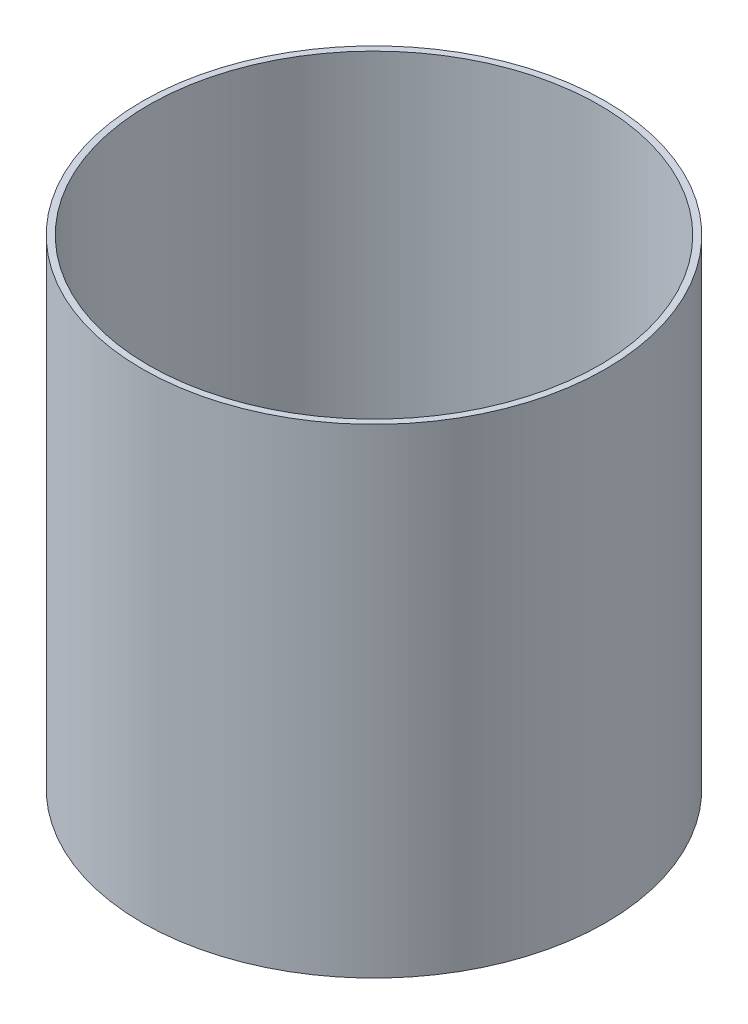
ISO-10303-21;
HEADER;
FILE_DESCRIPTION(('STEP AP214'),'2;1');
FILE_NAME('part.step','',(''),(''),'','','');
FILE_SCHEMA(('AUTOMOTIVE_DESIGN { 1 0 10303 214 1 1 1 1 }'));
ENDSEC;
DATA;
#1=APPLICATION_CONTEXT('core data for automotive mechanical design processes');
#2=APPLICATION_PROTOCOL_DEFINITION('international standard','automotive_design',2000,#1);
#3=PRODUCT_CONTEXT('',#1,'mechanical');
#4=PRODUCT('Part','Part','',(#3));
#5=PRODUCT_RELATED_PRODUCT_CATEGORY('part','',(#4));
#6=PRODUCT_DEFINITION_FORMATION('','',#4);
#7=PRODUCT_DEFINITION_CONTEXT('part definition',#1,'design');
#8=PRODUCT_DEFINITION('design','',#6,#7);
#9=PRODUCT_DEFINITION_SHAPE('','',#8);
#10=(LENGTH_UNIT() NAMED_UNIT(*) SI_UNIT(.MILLI.,.METRE.));
#11=(NAMED_UNIT(*) PLANE_ANGLE_UNIT() SI_UNIT($,.RADIAN.));
#12=(NAMED_UNIT(*) SI_UNIT($,.STERADIAN.) SOLID_ANGLE_UNIT());
#13=UNCERTAINTY_MEASURE_WITH_UNIT(LENGTH_MEASURE(1.E-05),#10,'distance_accuracy_value','');
#14=(GEOMETRIC_REPRESENTATION_CONTEXT(3) GLOBAL_UNCERTAINTY_ASSIGNED_CONTEXT((#13)) GLOBAL_UNIT_ASSIGNED_CONTEXT((#10,
#11,#12)) REPRESENTATION_CONTEXT('',''));
#15=CARTESIAN_POINT('',(0.,0.,0.));
#16=DIRECTION('',(0.,0.,1.));
#17=DIRECTION('',(1.,0.,0.));
#18=AXIS2_PLACEMENT_3D('',#15,#16,#17);
#19=CARTESIAN_POINT('',(0.,-300.,0.));
#20=DIRECTION('',(0.,1.,0.));
#21=DIRECTION('',(0.,0.,1.));
#22=AXIS2_PLACEMENT_3D('',#19,#20,#21);
#23=CYLINDRICAL_SURFACE('',#22,145.);
#24=CARTESIAN_POINT('',(0.,-300.,0.));
#25=DIRECTION('',(0.,1.,0.));
#26=DIRECTION('',(0.,0.,1.));
#27=AXIS2_PLACEMENT_3D('',#24,#25,#26);
#28=CIRCLE('',#27,145.);
#29=CARTESIAN_POINT('',(0.,-300.,145.));
#30=VERTEX_POINT('',#29);
#31=EDGE_CURVE('E10',#30,#30,#28,.T.);
#32=ORIENTED_EDGE('',*,*,#31,.T.);
#33=EDGE_LOOP('',(#32));
#34=FACE_BOUND('',#33,.T.);
#35=CARTESIAN_POINT('',(0.,0.,0.));
#36=DIRECTION('',(0.,1.,0.));
#37=DIRECTION('',(0.,0.,1.));
#38=AXIS2_PLACEMENT_3D('',#35,#36,#37);
#39=CIRCLE('',#38,145.);
#40=CARTESIAN_POINT('',(0.,0.,145.));
#41=VERTEX_POINT('',#40);
#42=EDGE_CURVE('E37',#41,#41,#39,.T.);
#43=ORIENTED_EDGE('',*,*,#42,.F.);
#44=EDGE_LOOP('',(#43));
#45=FACE_BOUND('',#44,.T.);
#46=ADVANCED_FACE('F34',(#34,#45),#23,.T.);
#47=CARTESIAN_POINT('',(0.,-300.,0.));
#48=DIRECTION('',(0.,1.,0.));
#49=DIRECTION('',(0.,0.,1.));
#50=AXIS2_PLACEMENT_3D('',#47,#48,#49);
#51=PLANE('',#50);
#52=CARTESIAN_POINT('',(0.,-300.,0.));
#53=DIRECTION('',(0.,1.,0.));
#54=DIRECTION('',(0.,0.,1.));
#55=AXIS2_PLACEMENT_3D('',#52,#53,#54);
#56=CIRCLE('',#55,141.);
#57=CARTESIAN_POINT('',(0.,-300.,141.));
#58=VERTEX_POINT('',#57);
#59=EDGE_CURVE('E47',#58,#58,#56,.T.);
#60=ORIENTED_EDGE('',*,*,#59,.T.);
#61=EDGE_LOOP('',(#60));
#62=FACE_BOUND('',#61,.T.);
#63=ORIENTED_EDGE('',*,*,#31,.F.);
#64=EDGE_LOOP('',(#63));
#65=FACE_BOUND('',#64,.T.);
#66=ADVANCED_FACE('F56',(#62,#65),#51,.F.);
#67=CARTESIAN_POINT('',(0.,0.,0.));
#68=DIRECTION('',(0.,1.,0.));
#69=DIRECTION('',(0.,0.,1.));
#70=AXIS2_PLACEMENT_3D('',#67,#68,#69);
#71=PLANE('',#70);
#72=CARTESIAN_POINT('',(0.,0.,0.));
#73=DIRECTION('',(0.,1.,0.));
#74=DIRECTION('',(0.,0.,1.));
#75=AXIS2_PLACEMENT_3D('',#72,#73,#74);
#76=CIRCLE('',#75,141.);
#77=CARTESIAN_POINT('',(0.,0.,141.));
#78=VERTEX_POINT('',#77);
#79=EDGE_CURVE('E49',#78,#78,#76,.T.);
#80=ORIENTED_EDGE('',*,*,#79,.F.);
#81=EDGE_LOOP('',(#80));
#82=FACE_BOUND('',#81,.T.);
#83=ORIENTED_EDGE('',*,*,#42,.T.);
#84=EDGE_LOOP('',(#83));
#85=FACE_BOUND('',#84,.T.);
#86=ADVANCED_FACE('F62',(#82,#85),#71,.T.);
#87=CARTESIAN_POINT('',(0.,-300.,0.));
#88=DIRECTION('',(0.,1.,0.));
#89=DIRECTION('',(0.,0.,1.));
#90=AXIS2_PLACEMENT_3D('',#87,#88,#89);
#91=CYLINDRICAL_SURFACE('',#90,141.);
#92=ORIENTED_EDGE('',*,*,#59,.F.);
#93=EDGE_LOOP('',(#92));
#94=FACE_BOUND('',#93,.T.);
#95=ORIENTED_EDGE('',*,*,#79,.T.);
#96=EDGE_LOOP('',(#95));
#97=FACE_BOUND('',#96,.T.);
#98=ADVANCED_FACE('F59',(#94,#97),#91,.F.);
#99=CLOSED_SHELL('',(#46,#66,#86,#98));
#100=MANIFOLD_SOLID_BREP('B2',#99);
#101=ADVANCED_BREP_SHAPE_REPRESENTATION('',(#18,#100),#14);
#102=SHAPE_DEFINITION_REPRESENTATION(#9,#101);
ENDSEC;
END-ISO-10303-21;
